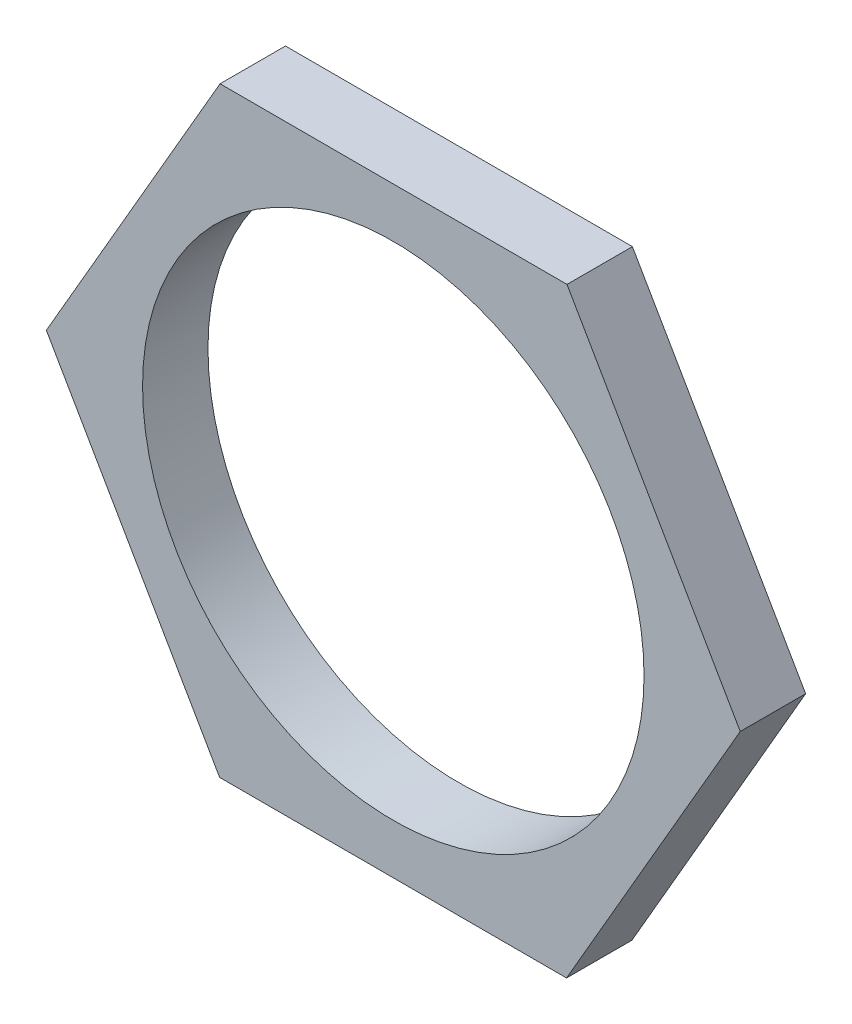
ISO-10303-21;
HEADER;
FILE_DESCRIPTION(('STEP AP214'),'2;1');
FILE_NAME('part.step','',(''),(''),'','','');
FILE_SCHEMA(('AUTOMOTIVE_DESIGN { 1 0 10303 214 1 1 1 1 }'));
ENDSEC;
DATA;
#1=APPLICATION_CONTEXT('core data for automotive mechanical design processes');
#2=APPLICATION_PROTOCOL_DEFINITION('international standard','automotive_design',2000,#1);
#3=PRODUCT_CONTEXT('',#1,'mechanical');
#4=PRODUCT('Part','Part','',(#3));
#5=PRODUCT_RELATED_PRODUCT_CATEGORY('part','',(#4));
#6=PRODUCT_DEFINITION_FORMATION('','',#4);
#7=PRODUCT_DEFINITION_CONTEXT('part definition',#1,'design');
#8=PRODUCT_DEFINITION('design','',#6,#7);
#9=PRODUCT_DEFINITION_SHAPE('','',#8);
#10=(LENGTH_UNIT() NAMED_UNIT(*) SI_UNIT(.MILLI.,.METRE.));
#11=(NAMED_UNIT(*) PLANE_ANGLE_UNIT() SI_UNIT($,.RADIAN.));
#12=(NAMED_UNIT(*) SI_UNIT($,.STERADIAN.) SOLID_ANGLE_UNIT());
#13=UNCERTAINTY_MEASURE_WITH_UNIT(LENGTH_MEASURE(1.E-05),#10,'distance_accuracy_value','');
#14=(GEOMETRIC_REPRESENTATION_CONTEXT(3) GLOBAL_UNCERTAINTY_ASSIGNED_CONTEXT((#13)) GLOBAL_UNIT_ASSIGNED_CONTEXT((#10,
#11,#12)) REPRESENTATION_CONTEXT('',''));
#15=CARTESIAN_POINT('',(0.,0.,0.));
#16=DIRECTION('',(0.,0.,1.));
#17=DIRECTION('',(1.,0.,0.));
#18=AXIS2_PLACEMENT_3D('',#15,#16,#17);
#19=CARTESIAN_POINT('',(0.,0.,3.));
#20=DIRECTION('',(0.,0.,1.));
#21=DIRECTION('',(1.,0.,0.));
#22=AXIS2_PLACEMENT_3D('',#19,#20,#21);
#23=PLANE('',#22);
#24=DIRECTION('',(-0.49931881181272,0.86641833092908,0.));
#25=VECTOR('',#24,1.);
#26=CARTESIAN_POINT('',(15.9123063577002,-0.0125132800354016,3.));
#27=LINE('',#26,#25);
#28=CARTESIAN_POINT('',(15.9123063577002,-0.0125132800354016,3.));
#29=VERTEX_POINT('',#28);
#30=CARTESIAN_POINT('',(7.96698999724545,13.7742048985513,3.));
#31=VERTEX_POINT('',#30);
#32=EDGE_CURVE('E129',#29,#31,#27,.T.);
#33=ORIENTED_EDGE('',*,*,#32,.T.);
#34=DIRECTION('',(-0.999999690795456,0.000786389847263397,0.));
#35=VECTOR('',#34,1.);
#36=CARTESIAN_POINT('',(7.96698999724545,13.7742048985513,3.));
#37=LINE('',#36,#35);
#38=CARTESIAN_POINT('',(-7.94531636045479,13.7867181785867,3.));
#39=VERTEX_POINT('',#38);
#40=EDGE_CURVE('E87',#31,#39,#37,.T.);
#41=ORIENTED_EDGE('',*,*,#40,.T.);
#42=DIRECTION('',(-0.500680878982736,-0.865631941081817,0.));
#43=VECTOR('',#42,1.);
#44=CARTESIAN_POINT('',(-7.94531636045479,13.7867181785867,3.));
#45=LINE('',#44,#43);
#46=CARTESIAN_POINT('',(-15.9123063577002,0.0125132800353981,3.));
#47=VERTEX_POINT('',#46);
#48=EDGE_CURVE('E100',#39,#47,#45,.T.);
#49=ORIENTED_EDGE('',*,*,#48,.T.);
#50=DIRECTION('',(0.49931881181272,-0.86641833092908,0.));
#51=VECTOR('',#50,1.);
#52=CARTESIAN_POINT('',(-15.9123063577002,0.0125132800353981,3.));
#53=LINE('',#52,#51);
#54=CARTESIAN_POINT('',(-7.96698999724544,-13.7742048985513,3.));
#55=VERTEX_POINT('',#54);
#56=EDGE_CURVE('E94',#47,#55,#53,.T.);
#57=ORIENTED_EDGE('',*,*,#56,.T.);
#58=DIRECTION('',(0.999999690795456,-0.000786389847263179,0.));
#59=VECTOR('',#58,1.);
#60=CARTESIAN_POINT('',(-7.96698999724544,-13.7742048985513,3.));
#61=LINE('',#60,#59);
#62=CARTESIAN_POINT('',(7.94531636045479,-13.7867181785867,3.));
#63=VERTEX_POINT('',#62);
#64=EDGE_CURVE('E98',#55,#63,#61,.T.);
#65=ORIENTED_EDGE('',*,*,#64,.T.);
#66=DIRECTION('',(0.500680878982736,0.865631941081817,0.));
#67=VECTOR('',#66,1.);
#68=CARTESIAN_POINT('',(7.94531636045479,-13.7867181785867,3.));
#69=LINE('',#68,#67);
#70=EDGE_CURVE('E50',#63,#29,#69,.T.);
#71=ORIENTED_EDGE('',*,*,#70,.T.);
#72=EDGE_LOOP('',(#33,#41,#49,#57,#65,#71));
#73=FACE_BOUND('',#72,.T.);
#74=CARTESIAN_POINT('',(0.,0.,3.));
#75=DIRECTION('',(0.,0.,1.));
#76=DIRECTION('',(1.,0.,0.));
#77=AXIS2_PLACEMENT_3D('',#74,#75,#76);
#78=CIRCLE('',#77,11.5);
#79=CARTESIAN_POINT('',(11.5,0.,3.));
#80=VERTEX_POINT('',#79);
#81=EDGE_CURVE('E122',#80,#80,#78,.T.);
#82=ORIENTED_EDGE('',*,*,#81,.F.);
#83=EDGE_LOOP('',(#82));
#84=FACE_BOUND('',#83,.T.);
#85=ADVANCED_FACE('F33',(#73,#84),#23,.T.);
#86=CARTESIAN_POINT('',(0.,0.,0.));
#87=DIRECTION('',(0.,0.,1.));
#88=DIRECTION('',(1.,0.,0.));
#89=AXIS2_PLACEMENT_3D('',#86,#87,#88);
#90=PLANE('',#89);
#91=DIRECTION('',(-0.49931881181272,0.86641833092908,0.));
#92=VECTOR('',#91,1.);
#93=CARTESIAN_POINT('',(15.9123063577002,-0.0125132800354016,0.));
#94=LINE('',#93,#92);
#95=CARTESIAN_POINT('',(15.9123063577002,-0.0125132800354016,0.));
#96=VERTEX_POINT('',#95);
#97=CARTESIAN_POINT('',(7.96698999724545,13.7742048985513,0.));
#98=VERTEX_POINT('',#97);
#99=EDGE_CURVE('E118',#96,#98,#94,.T.);
#100=ORIENTED_EDGE('',*,*,#99,.F.);
#101=DIRECTION('',(0.500680878982736,0.865631941081817,0.));
#102=VECTOR('',#101,1.);
#103=CARTESIAN_POINT('',(7.94531636045479,-13.7867181785867,0.));
#104=LINE('',#103,#102);
#105=CARTESIAN_POINT('',(7.94531636045479,-13.7867181785867,0.));
#106=VERTEX_POINT('',#105);
#107=EDGE_CURVE('E79',#106,#96,#104,.T.);
#108=ORIENTED_EDGE('',*,*,#107,.F.);
#109=DIRECTION('',(0.999999690795456,-0.000786389847263179,0.));
#110=VECTOR('',#109,1.);
#111=CARTESIAN_POINT('',(-7.96698999724544,-13.7742048985513,0.));
#112=LINE('',#111,#110);
#113=CARTESIAN_POINT('',(-7.96698999724544,-13.7742048985513,0.));
#114=VERTEX_POINT('',#113);
#115=EDGE_CURVE('E73',#114,#106,#112,.T.);
#116=ORIENTED_EDGE('',*,*,#115,.F.);
#117=DIRECTION('',(0.49931881181272,-0.86641833092908,0.));
#118=VECTOR('',#117,1.);
#119=CARTESIAN_POINT('',(-15.9123063577002,0.0125132800353981,0.));
#120=LINE('',#119,#118);
#121=CARTESIAN_POINT('',(-15.9123063577002,0.0125132800353981,0.));
#122=VERTEX_POINT('',#121);
#123=EDGE_CURVE('E108',#122,#114,#120,.T.);
#124=ORIENTED_EDGE('',*,*,#123,.F.);
#125=DIRECTION('',(-0.500680878982736,-0.865631941081817,0.));
#126=VECTOR('',#125,1.);
#127=CARTESIAN_POINT('',(-7.94531636045479,13.7867181785867,0.));
#128=LINE('',#127,#126);
#129=CARTESIAN_POINT('',(-7.94531636045479,13.7867181785867,0.));
#130=VERTEX_POINT('',#129);
#131=EDGE_CURVE('E124',#130,#122,#128,.T.);
#132=ORIENTED_EDGE('',*,*,#131,.F.);
#133=DIRECTION('',(-0.999999690795456,0.000786389847263397,0.));
#134=VECTOR('',#133,1.);
#135=CARTESIAN_POINT('',(7.96698999724545,13.7742048985513,0.));
#136=LINE('',#135,#134);
#137=EDGE_CURVE('E121',#98,#130,#136,.T.);
#138=ORIENTED_EDGE('',*,*,#137,.F.);
#139=EDGE_LOOP('',(#100,#108,#116,#124,#132,#138));
#140=FACE_BOUND('',#139,.T.);
#141=CARTESIAN_POINT('',(0.,0.,0.));
#142=DIRECTION('',(0.,0.,1.));
#143=DIRECTION('',(1.,0.,0.));
#144=AXIS2_PLACEMENT_3D('',#141,#142,#143);
#145=CIRCLE('',#144,11.5);
#146=CARTESIAN_POINT('',(11.5,0.,0.));
#147=VERTEX_POINT('',#146);
#148=EDGE_CURVE('E222',#147,#147,#145,.T.);
#149=ORIENTED_EDGE('',*,*,#148,.T.);
#150=EDGE_LOOP('',(#149));
#151=FACE_BOUND('',#150,.T.);
#152=ADVANCED_FACE('F138',(#140,#151),#90,.F.);
#153=CARTESIAN_POINT('',(15.9123063577002,-0.0125132800354016,3.));
#154=DIRECTION('',(-0.86641833092908,-0.49931881181272,0.));
#155=DIRECTION('',(0.49931881181272,-0.866418330929081,0.));
#156=AXIS2_PLACEMENT_3D('',#153,#154,#155);
#157=PLANE('',#156);
#158=ORIENTED_EDGE('',*,*,#99,.T.);
#159=DIRECTION('',(0.,0.,-1.));
#160=VECTOR('',#159,1.);
#161=CARTESIAN_POINT('',(7.96698999724545,13.7742048985513,3.));
#162=LINE('',#161,#160);
#163=EDGE_CURVE('E11',#31,#98,#162,.T.);
#164=ORIENTED_EDGE('',*,*,#163,.F.);
#165=ORIENTED_EDGE('',*,*,#32,.F.);
#166=DIRECTION('',(0.,0.,-1.));
#167=VECTOR('',#166,1.);
#168=CARTESIAN_POINT('',(15.9123063577002,-0.0125132800354016,3.));
#169=LINE('',#168,#167);
#170=EDGE_CURVE('E114',#29,#96,#169,.T.);
#171=ORIENTED_EDGE('',*,*,#170,.T.);
#172=EDGE_LOOP('',(#158,#164,#165,#171));
#173=FACE_BOUND('',#172,.T.);
#174=ADVANCED_FACE('F35',(#173),#157,.F.);
#175=CARTESIAN_POINT('',(7.96698999724545,13.7742048985513,3.));
#176=DIRECTION('',(-0.000786389847263397,-0.999999690795456,0.));
#177=DIRECTION('',(0.999999690795456,-0.000786389847263397,0.));
#178=AXIS2_PLACEMENT_3D('',#175,#176,#177);
#179=PLANE('',#178);
#180=ORIENTED_EDGE('',*,*,#137,.T.);
#181=DIRECTION('',(0.,0.,-1.));
#182=VECTOR('',#181,1.);
#183=CARTESIAN_POINT('',(-7.94531636045479,13.7867181785867,3.));
#184=LINE('',#183,#182);
#185=EDGE_CURVE('E42',#39,#130,#184,.T.);
#186=ORIENTED_EDGE('',*,*,#185,.F.);
#187=ORIENTED_EDGE('',*,*,#40,.F.);
#188=ORIENTED_EDGE('',*,*,#163,.T.);
#189=EDGE_LOOP('',(#180,#186,#187,#188));
#190=FACE_BOUND('',#189,.T.);
#191=ADVANCED_FACE('F163',(#190),#179,.F.);
#192=CARTESIAN_POINT('',(-7.94531636045479,13.7867181785867,3.));
#193=DIRECTION('',(0.865631941081817,-0.500680878982736,0.));
#194=DIRECTION('',(0.500680878982736,0.865631941081817,0.));
#195=AXIS2_PLACEMENT_3D('',#192,#193,#194);
#196=PLANE('',#195);
#197=ORIENTED_EDGE('',*,*,#131,.T.);
#198=DIRECTION('',(0.,0.,-1.));
#199=VECTOR('',#198,1.);
#200=CARTESIAN_POINT('',(-15.9123063577002,0.0125132800353981,3.));
#201=LINE('',#200,#199);
#202=EDGE_CURVE('E109',#47,#122,#201,.T.);
#203=ORIENTED_EDGE('',*,*,#202,.F.);
#204=ORIENTED_EDGE('',*,*,#48,.F.);
#205=ORIENTED_EDGE('',*,*,#185,.T.);
#206=EDGE_LOOP('',(#197,#203,#204,#205));
#207=FACE_BOUND('',#206,.T.);
#208=ADVANCED_FACE('F135',(#207),#196,.F.);
#209=CARTESIAN_POINT('',(-15.9123063577002,0.0125132800353981,3.));
#210=DIRECTION('',(0.86641833092908,0.49931881181272,0.));
#211=DIRECTION('',(-0.49931881181272,0.86641833092908,0.));
#212=AXIS2_PLACEMENT_3D('',#209,#210,#211);
#213=PLANE('',#212);
#214=ORIENTED_EDGE('',*,*,#123,.T.);
#215=DIRECTION('',(0.,0.,-1.));
#216=VECTOR('',#215,1.);
#217=CARTESIAN_POINT('',(-7.96698999724544,-13.7742048985513,3.));
#218=LINE('',#217,#216);
#219=EDGE_CURVE('E105',#55,#114,#218,.T.);
#220=ORIENTED_EDGE('',*,*,#219,.F.);
#221=ORIENTED_EDGE('',*,*,#56,.F.);
#222=ORIENTED_EDGE('',*,*,#202,.T.);
#223=EDGE_LOOP('',(#214,#220,#221,#222));
#224=FACE_BOUND('',#223,.T.);
#225=ADVANCED_FACE('F106',(#224),#213,.F.);
#226=CARTESIAN_POINT('',(-7.96698999724544,-13.7742048985513,3.));
#227=DIRECTION('',(0.000786389847263179,0.999999690795456,0.));
#228=DIRECTION('',(-0.999999690795456,0.000786389847263179,0.));
#229=AXIS2_PLACEMENT_3D('',#226,#227,#228);
#230=PLANE('',#229);
#231=ORIENTED_EDGE('',*,*,#115,.T.);
#232=DIRECTION('',(0.,0.,-1.));
#233=VECTOR('',#232,1.);
#234=CARTESIAN_POINT('',(7.94531636045479,-13.7867181785867,3.));
#235=LINE('',#234,#233);
#236=EDGE_CURVE('E110',#63,#106,#235,.T.);
#237=ORIENTED_EDGE('',*,*,#236,.F.);
#238=ORIENTED_EDGE('',*,*,#64,.F.);
#239=ORIENTED_EDGE('',*,*,#219,.T.);
#240=EDGE_LOOP('',(#231,#237,#238,#239));
#241=FACE_BOUND('',#240,.T.);
#242=ADVANCED_FACE('F112',(#241),#230,.F.);
#243=CARTESIAN_POINT('',(7.94531636045479,-13.7867181785867,3.));
#244=DIRECTION('',(-0.865631941081817,0.500680878982736,0.));
#245=DIRECTION('',(-0.500680878982736,-0.865631941081817,0.));
#246=AXIS2_PLACEMENT_3D('',#243,#244,#245);
#247=PLANE('',#246);
#248=ORIENTED_EDGE('',*,*,#107,.T.);
#249=ORIENTED_EDGE('',*,*,#170,.F.);
#250=ORIENTED_EDGE('',*,*,#70,.F.);
#251=ORIENTED_EDGE('',*,*,#236,.T.);
#252=EDGE_LOOP('',(#248,#249,#250,#251));
#253=FACE_BOUND('',#252,.T.);
#254=ADVANCED_FACE('F143',(#253),#247,.F.);
#255=CARTESIAN_POINT('',(0.,0.,3.));
#256=DIRECTION('',(0.,0.,-1.));
#257=DIRECTION('',(-1.,0.,0.));
#258=AXIS2_PLACEMENT_3D('',#255,#256,#257);
#259=CYLINDRICAL_SURFACE('',#258,11.5);
#260=ORIENTED_EDGE('',*,*,#81,.T.);
#261=EDGE_LOOP('',(#260));
#262=FACE_BOUND('',#261,.T.);
#263=ORIENTED_EDGE('',*,*,#148,.F.);
#264=EDGE_LOOP('',(#263));
#265=FACE_BOUND('',#264,.T.);
#266=ADVANCED_FACE('F145',(#262,#265),#259,.F.);
#267=CLOSED_SHELL('',(#85,#152,#174,#191,#208,#225,#242,#254,#266));
#268=MANIFOLD_SOLID_BREP('B2',#267);
#269=ADVANCED_BREP_SHAPE_REPRESENTATION('',(#18,#268),#14);
#270=SHAPE_DEFINITION_REPRESENTATION(#9,#269);
ENDSEC;
END-ISO-10303-21;
